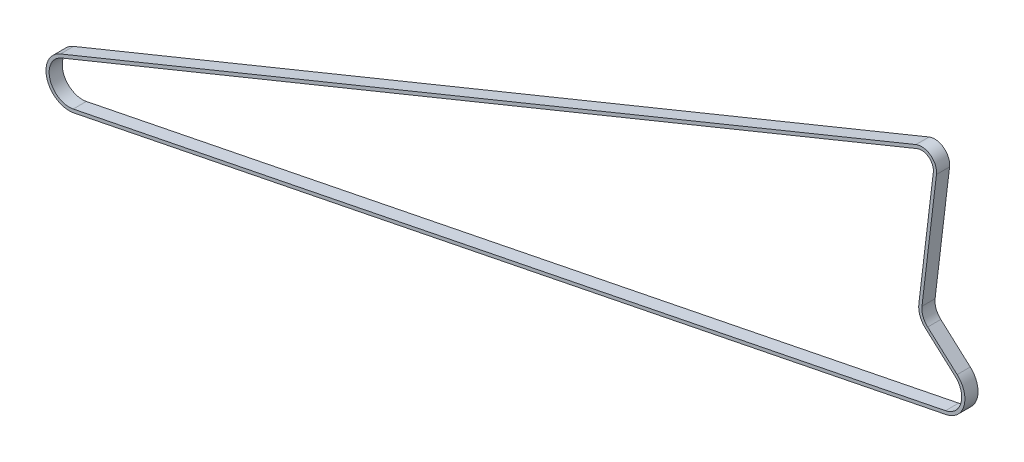
ISO-10303-21;
HEADER;
FILE_DESCRIPTION(('STEP AP214'),'2;1');
FILE_NAME('part.step','',(''),(''),'','','');
FILE_SCHEMA(('AUTOMOTIVE_DESIGN { 1 0 10303 214 1 1 1 1 }'));
ENDSEC;
DATA;
#1=APPLICATION_CONTEXT('core data for automotive mechanical design processes');
#2=APPLICATION_PROTOCOL_DEFINITION('international standard','automotive_design',2000,#1);
#3=PRODUCT_CONTEXT('',#1,'mechanical');
#4=PRODUCT('Part','Part','',(#3));
#5=PRODUCT_RELATED_PRODUCT_CATEGORY('part','',(#4));
#6=PRODUCT_DEFINITION_FORMATION('','',#4);
#7=PRODUCT_DEFINITION_CONTEXT('part definition',#1,'design');
#8=PRODUCT_DEFINITION('design','',#6,#7);
#9=PRODUCT_DEFINITION_SHAPE('','',#8);
#10=(LENGTH_UNIT() NAMED_UNIT(*) SI_UNIT(.MILLI.,.METRE.));
#11=(NAMED_UNIT(*) PLANE_ANGLE_UNIT() SI_UNIT($,.RADIAN.));
#12=(NAMED_UNIT(*) SI_UNIT($,.STERADIAN.) SOLID_ANGLE_UNIT());
#13=UNCERTAINTY_MEASURE_WITH_UNIT(LENGTH_MEASURE(1.E-05),#10,'distance_accuracy_value','');
#14=(GEOMETRIC_REPRESENTATION_CONTEXT(3) GLOBAL_UNCERTAINTY_ASSIGNED_CONTEXT((#13)) GLOBAL_UNIT_ASSIGNED_CONTEXT((#10,
#11,#12)) REPRESENTATION_CONTEXT('',''));
#15=CARTESIAN_POINT('',(0.,0.,0.));
#16=DIRECTION('',(0.,0.,1.));
#17=DIRECTION('',(1.,0.,0.));
#18=AXIS2_PLACEMENT_3D('',#15,#16,#17);
#19=CARTESIAN_POINT('',(0.,0.,0.));
#20=DIRECTION('',(0.,0.,-1.));
#21=DIRECTION('',(-1.,0.,0.));
#22=AXIS2_PLACEMENT_3D('',#19,#20,#21);
#23=CYLINDRICAL_SURFACE('',#22,9.2076525674065);
#24=DIRECTION('',(0.,0.,1.));
#25=VECTOR('',#24,1.);
#26=CARTESIAN_POINT('',(6.14978135792325,6.85281365949837,-3.));
#27=LINE('',#26,#25);
#28=CARTESIAN_POINT('',(6.14978135792325,6.85281365949837,-3.));
#29=VERTEX_POINT('',#28);
#30=CARTESIAN_POINT('',(6.14978135792325,6.85281365949837,3.));
#31=VERTEX_POINT('',#30);
#32=EDGE_CURVE('E262',#29,#31,#27,.T.);
#33=ORIENTED_EDGE('',*,*,#32,.F.);
#34=CARTESIAN_POINT('',(0.,0.,-3.));
#35=DIRECTION('',(0.,0.,-1.));
#36=DIRECTION('',(-1.,0.,0.));
#37=AXIS2_PLACEMENT_3D('',#34,#35,#36);
#38=CIRCLE('',#37,9.2076525674065);
#39=CARTESIAN_POINT('',(1.81012027581438,-9.0279748775211,-3.));
#40=VERTEX_POINT('',#39);
#41=EDGE_CURVE('E383',#29,#40,#38,.T.);
#42=ORIENTED_EDGE('',*,*,#41,.T.);
#43=CARTESIAN_POINT('',(1.81012027581438,-9.02797487752114,-3.));
#44=DIRECTION('',(0.,0.,1.));
#45=VECTOR('',#44,1.);
#46=LINE('',#43,#45);
#47=CARTESIAN_POINT('',(1.81012027581438,-9.0279748775211,3.));
#48=VERTEX_POINT('',#47);
#49=EDGE_CURVE('E360',#40,#48,#46,.T.);
#50=ORIENTED_EDGE('',*,*,#49,.T.);
#51=CARTESIAN_POINT('',(0.,0.,3.));
#52=DIRECTION('',(0.,0.,-1.));
#53=DIRECTION('',(-1.,0.,0.));
#54=AXIS2_PLACEMENT_3D('',#51,#52,#53);
#55=CIRCLE('',#54,9.2076525674065);
#56=EDGE_CURVE('E44',#31,#48,#55,.T.);
#57=ORIENTED_EDGE('',*,*,#56,.F.);
#58=EDGE_LOOP('',(#33,#42,#50,#57));
#59=FACE_BOUND('',#58,.T.);
#60=ADVANCED_FACE('F35',(#59),#23,.F.);
#61=CARTESIAN_POINT('',(0.,0.,0.));
#62=DIRECTION('',(0.,0.,-1.));
#63=DIRECTION('',(-1.,0.,0.));
#64=AXIS2_PLACEMENT_3D('',#61,#62,#63);
#65=CYLINDRICAL_SURFACE('',#64,10.6576525674065);
#66=DIRECTION('',(0.,0.,-1.));
#67=VECTOR('',#66,1.);
#68=CARTESIAN_POINT('',(7.11823481592558,7.93197903129426,-3.));
#69=LINE('',#68,#67);
#70=CARTESIAN_POINT('',(7.11823481592558,7.93197903129426,3.));
#71=VERTEX_POINT('',#70);
#72=CARTESIAN_POINT('',(7.11823481592558,7.93197903129426,-3.));
#73=VERTEX_POINT('',#72);
#74=EDGE_CURVE('E259',#71,#73,#69,.T.);
#75=ORIENTED_EDGE('',*,*,#74,.F.);
#76=CARTESIAN_POINT('',(0.,0.,3.));
#77=DIRECTION('',(0.,0.,-1.));
#78=DIRECTION('',(-1.,0.,0.));
#79=AXIS2_PLACEMENT_3D('',#76,#77,#78);
#80=CIRCLE('',#79,10.6576525674065);
#81=CARTESIAN_POINT('',(2.09517386365517,-10.4496796471759,3.));
#82=VERTEX_POINT('',#81);
#83=EDGE_CURVE('E11',#71,#82,#80,.T.);
#84=ORIENTED_EDGE('',*,*,#83,.T.);
#85=CARTESIAN_POINT('',(2.09517386365517,-10.4496796471759,3.));
#86=DIRECTION('',(0.,0.,-1.));
#87=VECTOR('',#86,1.);
#88=LINE('',#85,#87);
#89=CARTESIAN_POINT('',(2.09517386365517,-10.4496796471759,-3.));
#90=VERTEX_POINT('',#89);
#91=EDGE_CURVE('E52',#82,#90,#88,.T.);
#92=ORIENTED_EDGE('',*,*,#91,.T.);
#93=CARTESIAN_POINT('',(0.,0.,-3.));
#94=DIRECTION('',(0.,0.,-1.));
#95=DIRECTION('',(-1.,0.,0.));
#96=AXIS2_PLACEMENT_3D('',#93,#94,#95);
#97=CIRCLE('',#96,10.6576525674065);
#98=EDGE_CURVE('E168',#73,#90,#97,.T.);
#99=ORIENTED_EDGE('',*,*,#98,.F.);
#100=EDGE_LOOP('',(#75,#84,#92,#99));
#101=FACE_BOUND('',#100,.T.);
#102=ADVANCED_FACE('F279',(#101),#65,.T.);
#103=CARTESIAN_POINT('',(-7.32834242733819,18.9482125004542,-3.));
#104=DIRECTION('',(0.667898936553319,0.74425198054889,0.));
#105=DIRECTION('',(-0.74425198054889,0.667898936553319,0.));
#106=AXIS2_PLACEMENT_3D('',#103,#104,#105);
#107=PLANE('',#106);
#108=DIRECTION('',(0.,0.,1.));
#109=VECTOR('',#108,1.);
#110=CARTESIAN_POINT('',(-7.32834242733819,18.9482125004542,-3.));
#111=LINE('',#110,#109);
#112=CARTESIAN_POINT('',(-7.32834242733819,18.9482125004542,-3.));
#113=VERTEX_POINT('',#112);
#114=CARTESIAN_POINT('',(-7.32834242733819,18.9482125004542,3.));
#115=VERTEX_POINT('',#114);
#116=EDGE_CURVE('E244',#113,#115,#111,.T.);
#117=ORIENTED_EDGE('',*,*,#116,.F.);
#118=DIRECTION('',(0.74425198054889,-0.667898936553319,0.));
#119=VECTOR('',#118,1.);
#120=CARTESIAN_POINT('',(-7.32834242733819,18.9482125004542,-3.));
#121=LINE('',#120,#119);
#122=EDGE_CURVE('E267',#113,#29,#121,.T.);
#123=ORIENTED_EDGE('',*,*,#122,.T.);
#124=ORIENTED_EDGE('',*,*,#32,.T.);
#125=DIRECTION('',(0.74425198054889,-0.667898936553319,0.));
#126=VECTOR('',#125,1.);
#127=CARTESIAN_POINT('',(-7.32834242733819,18.9482125004542,3.));
#128=LINE('',#127,#126);
#129=EDGE_CURVE('E270',#115,#31,#128,.T.);
#130=ORIENTED_EDGE('',*,*,#129,.F.);
#131=EDGE_LOOP('',(#117,#123,#124,#130));
#132=FACE_BOUND('',#131,.T.);
#133=ADVANCED_FACE('F288',(#132),#107,.F.);
#134=CARTESIAN_POINT('',(-6.35988896933586,20.0273778722501,-3.));
#135=DIRECTION('',(-0.667898936553319,-0.74425198054889,0.));
#136=DIRECTION('',(0.74425198054889,-0.667898936553319,0.));
#137=AXIS2_PLACEMENT_3D('',#134,#135,#136);
#138=PLANE('',#137);
#139=DIRECTION('',(0.,0.,-1.));
#140=VECTOR('',#139,1.);
#141=CARTESIAN_POINT('',(-6.35988896933586,20.0273778722501,-3.));
#142=LINE('',#141,#140);
#143=CARTESIAN_POINT('',(-6.35988896933586,20.0273778722501,3.));
#144=VERTEX_POINT('',#143);
#145=CARTESIAN_POINT('',(-6.35988896933586,20.0273778722501,-3.));
#146=VERTEX_POINT('',#145);
#147=EDGE_CURVE('E241',#144,#146,#142,.T.);
#148=ORIENTED_EDGE('',*,*,#147,.F.);
#149=DIRECTION('',(0.74425198054889,-0.667898936553319,0.));
#150=VECTOR('',#149,1.);
#151=CARTESIAN_POINT('',(-6.35988896933586,20.0273778722501,3.));
#152=LINE('',#151,#150);
#153=EDGE_CURVE('E273',#144,#71,#152,.T.);
#154=ORIENTED_EDGE('',*,*,#153,.T.);
#155=ORIENTED_EDGE('',*,*,#74,.T.);
#156=DIRECTION('',(0.74425198054889,-0.667898936553319,0.));
#157=VECTOR('',#156,1.);
#158=CARTESIAN_POINT('',(-6.35988896933586,20.0273778722501,-3.));
#159=LINE('',#158,#157);
#160=EDGE_CURVE('E265',#146,#73,#159,.T.);
#161=ORIENTED_EDGE('',*,*,#160,.F.);
#162=EDGE_LOOP('',(#148,#154,#155,#161));
#163=FACE_BOUND('',#162,.T.);
#164=ADVANCED_FACE('F291',(#163),#138,.F.);
#165=CARTESIAN_POINT('',(-1.00000000349554,26.0000000161549,0.));
#166=DIRECTION('',(0.,0.,1.));
#167=DIRECTION('',(1.,0.,0.));
#168=AXIS2_PLACEMENT_3D('',#165,#166,#167);
#169=CYLINDRICAL_SURFACE('',#168,9.47499999999996);
#170=DIRECTION('',(0.,0.,1.));
#171=VECTOR('',#170,1.);
#172=CARTESIAN_POINT('',(-10.4082737750463,27.1225015259755,-3.));
#173=LINE('',#172,#171);
#174=CARTESIAN_POINT('',(-10.4082737750463,27.1225015259755,-3.));
#175=VERTEX_POINT('',#174);
#176=CARTESIAN_POINT('',(-10.4082737750463,27.1225015259755,3.));
#177=VERTEX_POINT('',#176);
#178=EDGE_CURVE('E226',#175,#177,#173,.T.);
#179=ORIENTED_EDGE('',*,*,#178,.F.);
#180=CARTESIAN_POINT('',(-1.00000000349554,26.0000000161549,-3.));
#181=DIRECTION('',(0.,0.,1.));
#182=DIRECTION('',(1.,0.,0.));
#183=AXIS2_PLACEMENT_3D('',#180,#181,#182);
#184=CIRCLE('',#183,9.47499999999996);
#185=EDGE_CURVE('E250',#175,#113,#184,.T.);
#186=ORIENTED_EDGE('',*,*,#185,.T.);
#187=ORIENTED_EDGE('',*,*,#116,.T.);
#188=CARTESIAN_POINT('',(-1.00000000349554,26.0000000161549,3.));
#189=DIRECTION('',(0.,0.,1.));
#190=DIRECTION('',(1.,0.,0.));
#191=AXIS2_PLACEMENT_3D('',#188,#189,#190);
#192=CIRCLE('',#191,9.47499999999996);
#193=EDGE_CURVE('E253',#177,#115,#192,.T.);
#194=ORIENTED_EDGE('',*,*,#193,.F.);
#195=EDGE_LOOP('',(#179,#186,#187,#194));
#196=FACE_BOUND('',#195,.T.);
#197=ADVANCED_FACE('F295',(#196),#169,.T.);
#198=CARTESIAN_POINT('',(-1.00000000349554,26.0000000161549,0.));
#199=DIRECTION('',(0.,0.,1.));
#200=DIRECTION('',(1.,0.,0.));
#201=AXIS2_PLACEMENT_3D('',#198,#199,#200);
#202=CYLINDRICAL_SURFACE('',#201,8.02499999999995);
#203=DIRECTION('',(0.,0.,-1.));
#204=VECTOR('',#203,1.);
#205=CARTESIAN_POINT('',(-8.96848517676146,26.9507202922826,-3.));
#206=LINE('',#205,#204);
#207=CARTESIAN_POINT('',(-8.96848517676146,26.9507202922826,3.));
#208=VERTEX_POINT('',#207);
#209=CARTESIAN_POINT('',(-8.96848517676146,26.9507202922826,-3.));
#210=VERTEX_POINT('',#209);
#211=EDGE_CURVE('E223',#208,#210,#206,.T.);
#212=ORIENTED_EDGE('',*,*,#211,.F.);
#213=CARTESIAN_POINT('',(-1.00000000349554,26.0000000161549,3.));
#214=DIRECTION('',(0.,0.,1.));
#215=DIRECTION('',(1.,0.,0.));
#216=AXIS2_PLACEMENT_3D('',#213,#214,#215);
#217=CIRCLE('',#216,8.02499999999995);
#218=EDGE_CURVE('E256',#208,#144,#217,.T.);
#219=ORIENTED_EDGE('',*,*,#218,.T.);
#220=ORIENTED_EDGE('',*,*,#147,.T.);
#221=CARTESIAN_POINT('',(-1.00000000349554,26.0000000161549,-3.));
#222=DIRECTION('',(0.,0.,1.));
#223=DIRECTION('',(1.,0.,0.));
#224=AXIS2_PLACEMENT_3D('',#221,#222,#223);
#225=CIRCLE('',#224,8.02499999999995);
#226=EDGE_CURVE('E247',#210,#146,#225,.T.);
#227=ORIENTED_EDGE('',*,*,#226,.F.);
#228=EDGE_LOOP('',(#212,#219,#220,#227));
#229=FACE_BOUND('',#228,.T.);
#230=ADVANCED_FACE('F299',(#229),#202,.F.);
#231=CARTESIAN_POINT('',(-3.78557558519489,82.6308078679699,-3.));
#232=DIRECTION('',(0.992957653989528,-0.11846981633991,0.));
#233=DIRECTION('',(0.11846981633991,0.992957653989528,0.));
#234=AXIS2_PLACEMENT_3D('',#231,#232,#233);
#235=PLANE('',#234);
#236=DIRECTION('',(0.,0.,1.));
#237=VECTOR('',#236,1.);
#238=CARTESIAN_POINT('',(-3.78557558519489,82.6308078679699,-3.));
#239=LINE('',#238,#237);
#240=CARTESIAN_POINT('',(-3.78557558519489,82.6308078679699,-3.));
#241=VERTEX_POINT('',#240);
#242=CARTESIAN_POINT('',(-3.78557558519489,82.6308078679699,3.));
#243=VERTEX_POINT('',#242);
#244=EDGE_CURVE('E208',#241,#243,#239,.T.);
#245=ORIENTED_EDGE('',*,*,#244,.F.);
#246=DIRECTION('',(-0.11846981633991,-0.992957653989528,0.));
#247=VECTOR('',#246,1.);
#248=CARTESIAN_POINT('',(-3.78557558519489,82.6308078679699,-3.));
#249=LINE('',#248,#247);
#250=EDGE_CURVE('E232',#241,#175,#249,.T.);
#251=ORIENTED_EDGE('',*,*,#250,.T.);
#252=ORIENTED_EDGE('',*,*,#178,.T.);
#253=DIRECTION('',(-0.11846981633991,-0.992957653989528,0.));
#254=VECTOR('',#253,1.);
#255=CARTESIAN_POINT('',(-3.78557558519489,82.6308078679699,3.));
#256=LINE('',#255,#254);
#257=EDGE_CURVE('E235',#243,#177,#256,.T.);
#258=ORIENTED_EDGE('',*,*,#257,.F.);
#259=EDGE_LOOP('',(#245,#251,#252,#258));
#260=FACE_BOUND('',#259,.T.);
#261=ADVANCED_FACE('F303',(#260),#235,.F.);
#262=CARTESIAN_POINT('',(-2.34578698691007,82.459026634277,-3.));
#263=DIRECTION('',(-0.992957653989528,0.11846981633991,0.));
#264=DIRECTION('',(-0.11846981633991,-0.992957653989528,0.));
#265=AXIS2_PLACEMENT_3D('',#262,#263,#264);
#266=PLANE('',#265);
#267=DIRECTION('',(0.,0.,-1.));
#268=VECTOR('',#267,1.);
#269=CARTESIAN_POINT('',(-2.34578698691007,82.459026634277,-3.));
#270=LINE('',#269,#268);
#271=CARTESIAN_POINT('',(-2.34578698691007,82.459026634277,3.));
#272=VERTEX_POINT('',#271);
#273=CARTESIAN_POINT('',(-2.34578698691007,82.459026634277,-3.));
#274=VERTEX_POINT('',#273);
#275=EDGE_CURVE('E205',#272,#274,#270,.T.);
#276=ORIENTED_EDGE('',*,*,#275,.F.);
#277=DIRECTION('',(-0.11846981633991,-0.992957653989528,0.));
#278=VECTOR('',#277,1.);
#279=CARTESIAN_POINT('',(-2.34578698691007,82.459026634277,3.));
#280=LINE('',#279,#278);
#281=EDGE_CURVE('E238',#272,#208,#280,.T.);
#282=ORIENTED_EDGE('',*,*,#281,.T.);
#283=ORIENTED_EDGE('',*,*,#211,.T.);
#284=DIRECTION('',(-0.11846981633991,-0.992957653989528,0.));
#285=VECTOR('',#284,1.);
#286=CARTESIAN_POINT('',(-2.34578698691007,82.459026634277,-3.));
#287=LINE('',#286,#285);
#288=EDGE_CURVE('E229',#274,#210,#287,.T.);
#289=ORIENTED_EDGE('',*,*,#288,.F.);
#290=EDGE_LOOP('',(#276,#282,#283,#289));
#291=FACE_BOUND('',#290,.T.);
#292=ADVANCED_FACE('F307',(#291),#266,.F.);
#293=CARTESIAN_POINT('',(-9.15000000342125,83.270837554073,0.));
#294=DIRECTION('',(0.,0.,-1.));
#295=DIRECTION('',(-1.,0.,0.));
#296=AXIS2_PLACEMENT_3D('',#293,#294,#295);
#297=CYLINDRICAL_SURFACE('',#296,5.40247048469091);
#298=DIRECTION('',(0.,0.,1.));
#299=VECTOR('',#298,1.);
#300=CARTESIAN_POINT('',(-11.1919986141999,88.272530168732,-3.));
#301=LINE('',#300,#299);
#302=CARTESIAN_POINT('',(-11.1919986141999,88.272530168732,-3.));
#303=VERTEX_POINT('',#302);
#304=CARTESIAN_POINT('',(-11.1919986141999,88.272530168732,3.));
#305=VERTEX_POINT('',#304);
#306=EDGE_CURVE('E191',#303,#305,#301,.T.);
#307=ORIENTED_EDGE('',*,*,#306,.F.);
#308=CARTESIAN_POINT('',(-9.15000000342125,83.270837554073,-3.));
#309=DIRECTION('',(0.,0.,-1.));
#310=DIRECTION('',(-1.,0.,0.));
#311=AXIS2_PLACEMENT_3D('',#308,#309,#310);
#312=CIRCLE('',#311,5.40247048469091);
#313=EDGE_CURVE('E214',#303,#241,#312,.T.);
#314=ORIENTED_EDGE('',*,*,#313,.T.);
#315=ORIENTED_EDGE('',*,*,#244,.T.);
#316=CARTESIAN_POINT('',(-9.15000000342125,83.270837554073,3.));
#317=DIRECTION('',(0.,0.,-1.));
#318=DIRECTION('',(-1.,0.,0.));
#319=AXIS2_PLACEMENT_3D('',#316,#317,#318);
#320=CIRCLE('',#319,5.40247048469091);
#321=EDGE_CURVE('E217',#305,#243,#320,.T.);
#322=ORIENTED_EDGE('',*,*,#321,.F.);
#323=EDGE_LOOP('',(#307,#314,#315,#322));
#324=FACE_BOUND('',#323,.T.);
#325=ADVANCED_FACE('F311',(#324),#297,.F.);
#326=CARTESIAN_POINT('',(-9.15000000342125,83.270837554073,0.));
#327=DIRECTION('',(0.,0.,-1.));
#328=DIRECTION('',(-1.,0.,0.));
#329=AXIS2_PLACEMENT_3D('',#326,#327,#328);
#330=CYLINDRICAL_SURFACE('',#329,6.85247048469091);
#331=DIRECTION('',(0.,0.,-1.));
#332=VECTOR('',#331,1.);
#333=CARTESIAN_POINT('',(-11.7400623183922,89.6149631004448,-3.));
#334=LINE('',#333,#332);
#335=CARTESIAN_POINT('',(-11.7400623183922,89.6149631004448,3.));
#336=VERTEX_POINT('',#335);
#337=CARTESIAN_POINT('',(-11.7400623183922,89.6149631004448,-3.));
#338=VERTEX_POINT('',#337);
#339=EDGE_CURVE('E188',#336,#338,#334,.T.);
#340=ORIENTED_EDGE('',*,*,#339,.F.);
#341=CARTESIAN_POINT('',(-9.15000000342125,83.270837554073,3.));
#342=DIRECTION('',(0.,0.,-1.));
#343=DIRECTION('',(-1.,0.,0.));
#344=AXIS2_PLACEMENT_3D('',#341,#342,#343);
#345=CIRCLE('',#344,6.85247048469091);
#346=EDGE_CURVE('E220',#336,#272,#345,.T.);
#347=ORIENTED_EDGE('',*,*,#346,.T.);
#348=ORIENTED_EDGE('',*,*,#275,.T.);
#349=CARTESIAN_POINT('',(-9.15000000342125,83.270837554073,-3.));
#350=DIRECTION('',(0.,0.,-1.));
#351=DIRECTION('',(-1.,0.,0.));
#352=AXIS2_PLACEMENT_3D('',#349,#350,#351);
#353=CIRCLE('',#352,6.85247048469091);
#354=EDGE_CURVE('E211',#338,#274,#353,.T.);
#355=ORIENTED_EDGE('',*,*,#354,.F.);
#356=EDGE_LOOP('',(#340,#347,#348,#355));
#357=FACE_BOUND('',#356,.T.);
#358=ADVANCED_FACE('F315',(#357),#330,.T.);
#359=CARTESIAN_POINT('',(-402.480262191639,-71.4754096181702,-3.));
#360=DIRECTION('',(-0.377974968408462,0.925815814974351,0.));
#361=DIRECTION('',(-0.925815814974351,-0.377974968408462,0.));
#362=AXIS2_PLACEMENT_3D('',#359,#360,#361);
#363=PLANE('',#362);
#364=DIRECTION('',(0.,0.,1.));
#365=VECTOR('',#364,1.);
#366=CARTESIAN_POINT('',(-402.480262191639,-71.4754096181702,-3.));
#367=LINE('',#366,#365);
#368=CARTESIAN_POINT('',(-402.480262191639,-71.4754096181702,-3.));
#369=VERTEX_POINT('',#368);
#370=CARTESIAN_POINT('',(-402.480262191639,-71.4754096181702,3.));
#371=VERTEX_POINT('',#370);
#372=EDGE_CURVE('E163',#369,#371,#367,.T.);
#373=ORIENTED_EDGE('',*,*,#372,.F.);
#374=DIRECTION('',(0.925815814974351,0.377974968408462,0.));
#375=VECTOR('',#374,1.);
#376=CARTESIAN_POINT('',(-402.480262191639,-71.4754096181702,-3.));
#377=LINE('',#376,#375);
#378=EDGE_CURVE('E196',#369,#303,#377,.T.);
#379=ORIENTED_EDGE('',*,*,#378,.T.);
#380=ORIENTED_EDGE('',*,*,#306,.T.);
#381=DIRECTION('',(0.925815814974351,0.377974968408462,0.));
#382=VECTOR('',#381,1.);
#383=CARTESIAN_POINT('',(-402.480262191639,-71.4754096181702,3.));
#384=LINE('',#383,#382);
#385=EDGE_CURVE('E199',#371,#305,#384,.T.);
#386=ORIENTED_EDGE('',*,*,#385,.F.);
#387=EDGE_LOOP('',(#373,#379,#380,#386));
#388=FACE_BOUND('',#387,.T.);
#389=ADVANCED_FACE('F319',(#388),#363,.F.);
#390=CARTESIAN_POINT('',(-403.028325895831,-70.1329766864574,-3.));
#391=DIRECTION('',(0.377974968408462,-0.925815814974351,0.));
#392=DIRECTION('',(0.925815814974351,0.377974968408462,0.));
#393=AXIS2_PLACEMENT_3D('',#390,#391,#392);
#394=PLANE('',#393);
#395=DIRECTION('',(0.,0.,-1.));
#396=VECTOR('',#395,1.);
#397=CARTESIAN_POINT('',(-403.028325895831,-70.1329766864574,-3.));
#398=LINE('',#397,#396);
#399=CARTESIAN_POINT('',(-403.028325895831,-70.1329766864574,3.));
#400=VERTEX_POINT('',#399);
#401=CARTESIAN_POINT('',(-403.028325895831,-70.1329766864574,-3.));
#402=VERTEX_POINT('',#401);
#403=EDGE_CURVE('E159',#400,#402,#398,.T.);
#404=ORIENTED_EDGE('',*,*,#403,.F.);
#405=DIRECTION('',(0.925815814974351,0.377974968408462,0.));
#406=VECTOR('',#405,1.);
#407=CARTESIAN_POINT('',(-403.028325895831,-70.1329766864574,3.));
#408=LINE('',#407,#406);
#409=EDGE_CURVE('E202',#400,#336,#408,.T.);
#410=ORIENTED_EDGE('',*,*,#409,.T.);
#411=ORIENTED_EDGE('',*,*,#339,.T.);
#412=DIRECTION('',(0.925815814974351,0.377974968408462,0.));
#413=VECTOR('',#412,1.);
#414=CARTESIAN_POINT('',(-403.028325895831,-70.1329766864574,-3.));
#415=LINE('',#414,#413);
#416=EDGE_CURVE('E194',#402,#338,#415,.T.);
#417=ORIENTED_EDGE('',*,*,#416,.F.);
#418=EDGE_LOOP('',(#404,#410,#411,#417));
#419=FACE_BOUND('',#418,.T.);
#420=ADVANCED_FACE('F323',(#419),#394,.F.);
#421=CARTESIAN_POINT('',(-399.000000003357,-79.9999999838643,0.));
#422=DIRECTION('',(0.,0.,-1.));
#423=DIRECTION('',(-1.,0.,0.));
#424=AXIS2_PLACEMENT_3D('',#421,#422,#423);
#425=CYLINDRICAL_SURFACE('',#424,9.20765256740647);
#426=DIRECTION('',(0.,0.,1.));
#427=VECTOR('',#426,1.);
#428=CARTESIAN_POINT('',(-397.189879727543,-89.0279748613854,-3.));
#429=LINE('',#428,#427);
#430=CARTESIAN_POINT('',(-397.189879727543,-89.0279748613854,-3.));
#431=VERTEX_POINT('',#430);
#432=CARTESIAN_POINT('',(-397.189879727543,-89.0279748613854,3.));
#433=VERTEX_POINT('',#432);
#434=EDGE_CURVE('E170',#431,#433,#429,.T.);
#435=ORIENTED_EDGE('',*,*,#434,.F.);
#436=CARTESIAN_POINT('',(-399.000000003357,-79.9999999838643,-3.));
#437=DIRECTION('',(0.,0.,-1.));
#438=DIRECTION('',(-1.,0.,0.));
#439=AXIS2_PLACEMENT_3D('',#436,#437,#438);
#440=CIRCLE('',#439,9.20765256740647);
#441=EDGE_CURVE('E162',#431,#369,#440,.T.);
#442=ORIENTED_EDGE('',*,*,#441,.T.);
#443=ORIENTED_EDGE('',*,*,#372,.T.);
#444=CARTESIAN_POINT('',(-399.000000003357,-79.9999999838643,3.));
#445=DIRECTION('',(0.,0.,-1.));
#446=DIRECTION('',(-1.,0.,0.));
#447=AXIS2_PLACEMENT_3D('',#444,#445,#446);
#448=CIRCLE('',#447,9.20765256740647);
#449=EDGE_CURVE('E183',#433,#371,#448,.T.);
#450=ORIENTED_EDGE('',*,*,#449,.F.);
#451=EDGE_LOOP('',(#435,#442,#443,#450));
#452=FACE_BOUND('',#451,.T.);
#453=ADVANCED_FACE('F327',(#452),#425,.F.);
#454=CARTESIAN_POINT('',(-399.000000003357,-79.9999999838643,0.));
#455=DIRECTION('',(0.,0.,-1.));
#456=DIRECTION('',(-1.,0.,0.));
#457=AXIS2_PLACEMENT_3D('',#454,#455,#456);
#458=CYLINDRICAL_SURFACE('',#457,10.6576525674065);
#459=DIRECTION('',(0.,0.,-1.));
#460=VECTOR('',#459,1.);
#461=CARTESIAN_POINT('',(-396.904826139702,-90.4496796310402,-3.));
#462=LINE('',#461,#460);
#463=CARTESIAN_POINT('',(-396.904826139702,-90.4496796310402,3.));
#464=VERTEX_POINT('',#463);
#465=CARTESIAN_POINT('',(-396.904826139702,-90.4496796310402,-3.));
#466=VERTEX_POINT('',#465);
#467=EDGE_CURVE('E157',#464,#466,#462,.T.);
#468=ORIENTED_EDGE('',*,*,#467,.F.);
#469=CARTESIAN_POINT('',(-399.000000003357,-79.9999999838643,3.));
#470=DIRECTION('',(0.,0.,-1.));
#471=DIRECTION('',(-1.,0.,0.));
#472=AXIS2_PLACEMENT_3D('',#469,#470,#471);
#473=CIRCLE('',#472,10.6576525674065);
#474=EDGE_CURVE('E186',#464,#400,#473,.T.);
#475=ORIENTED_EDGE('',*,*,#474,.T.);
#476=ORIENTED_EDGE('',*,*,#403,.T.);
#477=CARTESIAN_POINT('',(-399.000000003357,-79.9999999838643,-3.));
#478=DIRECTION('',(0.,0.,-1.));
#479=DIRECTION('',(-1.,0.,0.));
#480=AXIS2_PLACEMENT_3D('',#477,#478,#479);
#481=CIRCLE('',#480,10.6576525674065);
#482=EDGE_CURVE('E152',#466,#402,#481,.T.);
#483=ORIENTED_EDGE('',*,*,#482,.F.);
#484=EDGE_LOOP('',(#468,#475,#476,#483));
#485=FACE_BOUND('',#484,.T.);
#486=ADVANCED_FACE('F154',(#485),#458,.T.);
#487=CARTESIAN_POINT('',(-396.904826139702,-90.4496796310402,-3.));
#488=DIRECTION('',(0.196588681269524,-0.980486048037763,0.));
#489=DIRECTION('',(0.980486048037763,0.196588681269524,0.));
#490=AXIS2_PLACEMENT_3D('',#487,#488,#489);
#491=PLANE('',#490);
#492=ORIENTED_EDGE('',*,*,#91,.F.);
#493=DIRECTION('',(0.980486048037763,0.196588681269524,0.));
#494=VECTOR('',#493,1.);
#495=CARTESIAN_POINT('',(-396.904826139702,-90.4496796310402,3.));
#496=LINE('',#495,#494);
#497=EDGE_CURVE('E173',#464,#82,#496,.T.);
#498=ORIENTED_EDGE('',*,*,#497,.F.);
#499=ORIENTED_EDGE('',*,*,#467,.T.);
#500=DIRECTION('',(0.980486048037763,0.196588681269524,0.));
#501=VECTOR('',#500,1.);
#502=CARTESIAN_POINT('',(-396.904826139702,-90.4496796310402,-3.));
#503=LINE('',#502,#501);
#504=EDGE_CURVE('E165',#466,#90,#503,.T.);
#505=ORIENTED_EDGE('',*,*,#504,.T.);
#506=EDGE_LOOP('',(#492,#498,#499,#505));
#507=FACE_BOUND('',#506,.T.);
#508=ADVANCED_FACE('F172',(#507),#491,.T.);
#509=CARTESIAN_POINT('',(-396.904826139702,-90.4496796310402,3.));
#510=DIRECTION('',(0.,0.,1.));
#511=DIRECTION('',(1.,0.,0.));
#512=AXIS2_PLACEMENT_3D('',#509,#510,#511);
#513=PLANE('',#512);
#514=ORIENTED_EDGE('',*,*,#474,.F.);
#515=ORIENTED_EDGE('',*,*,#497,.T.);
#516=ORIENTED_EDGE('',*,*,#83,.F.);
#517=ORIENTED_EDGE('',*,*,#153,.F.);
#518=ORIENTED_EDGE('',*,*,#218,.F.);
#519=ORIENTED_EDGE('',*,*,#281,.F.);
#520=ORIENTED_EDGE('',*,*,#346,.F.);
#521=ORIENTED_EDGE('',*,*,#409,.F.);
#522=EDGE_LOOP('',(#514,#515,#516,#517,#518,#519,#520,#521));
#523=FACE_BOUND('',#522,.T.);
#524=DIRECTION('',(0.980486048037763,0.196588681269524,0.));
#525=VECTOR('',#524,1.);
#526=CARTESIAN_POINT('',(-397.189879727543,-89.0279748613854,3.));
#527=LINE('',#526,#525);
#528=EDGE_CURVE('E351',#433,#48,#527,.T.);
#529=ORIENTED_EDGE('',*,*,#528,.F.);
#530=ORIENTED_EDGE('',*,*,#449,.T.);
#531=ORIENTED_EDGE('',*,*,#385,.T.);
#532=ORIENTED_EDGE('',*,*,#321,.T.);
#533=ORIENTED_EDGE('',*,*,#257,.T.);
#534=ORIENTED_EDGE('',*,*,#193,.T.);
#535=ORIENTED_EDGE('',*,*,#129,.T.);
#536=ORIENTED_EDGE('',*,*,#56,.T.);
#537=EDGE_LOOP('',(#529,#530,#531,#532,#533,#534,#535,#536));
#538=FACE_BOUND('',#537,.T.);
#539=ADVANCED_FACE('F337',(#523,#538),#513,.T.);
#540=CARTESIAN_POINT('',(-397.189879727543,-89.0279748613854,-3.));
#541=DIRECTION('',(-0.196588681269524,0.980486048037763,0.));
#542=DIRECTION('',(-0.980486048037763,-0.196588681269524,0.));
#543=AXIS2_PLACEMENT_3D('',#540,#541,#542);
#544=PLANE('',#543);
#545=ORIENTED_EDGE('',*,*,#49,.F.);
#546=DIRECTION('',(0.980486048037763,0.196588681269524,0.));
#547=VECTOR('',#546,1.);
#548=CARTESIAN_POINT('',(-397.189879727543,-89.0279748613854,-3.));
#549=LINE('',#548,#547);
#550=EDGE_CURVE('E169',#431,#40,#549,.T.);
#551=ORIENTED_EDGE('',*,*,#550,.F.);
#552=ORIENTED_EDGE('',*,*,#434,.T.);
#553=ORIENTED_EDGE('',*,*,#528,.T.);
#554=EDGE_LOOP('',(#545,#551,#552,#553));
#555=FACE_BOUND('',#554,.T.);
#556=ADVANCED_FACE('F364',(#555),#544,.T.);
#557=CARTESIAN_POINT('',(-396.904826139702,-90.4496796310402,-3.));
#558=DIRECTION('',(0.,0.,-1.));
#559=DIRECTION('',(0.,1.,0.));
#560=AXIS2_PLACEMENT_3D('',#557,#558,#559);
#561=PLANE('',#560);
#562=ORIENTED_EDGE('',*,*,#441,.F.);
#563=ORIENTED_EDGE('',*,*,#550,.T.);
#564=ORIENTED_EDGE('',*,*,#41,.F.);
#565=ORIENTED_EDGE('',*,*,#122,.F.);
#566=ORIENTED_EDGE('',*,*,#185,.F.);
#567=ORIENTED_EDGE('',*,*,#250,.F.);
#568=ORIENTED_EDGE('',*,*,#313,.F.);
#569=ORIENTED_EDGE('',*,*,#378,.F.);
#570=EDGE_LOOP('',(#562,#563,#564,#565,#566,#567,#568,#569));
#571=FACE_BOUND('',#570,.T.);
#572=ORIENTED_EDGE('',*,*,#504,.F.);
#573=ORIENTED_EDGE('',*,*,#482,.T.);
#574=ORIENTED_EDGE('',*,*,#416,.T.);
#575=ORIENTED_EDGE('',*,*,#354,.T.);
#576=ORIENTED_EDGE('',*,*,#288,.T.);
#577=ORIENTED_EDGE('',*,*,#226,.T.);
#578=ORIENTED_EDGE('',*,*,#160,.T.);
#579=ORIENTED_EDGE('',*,*,#98,.T.);
#580=EDGE_LOOP('',(#572,#573,#574,#575,#576,#577,#578,#579));
#581=FACE_BOUND('',#580,.T.);
#582=ADVANCED_FACE('F166',(#571,#581),#561,.T.);
#583=CLOSED_SHELL('',(#60,#102,#133,#164,#197,#230,#261,#292,#325,#358,#389,#420,#453,#486,#508,
#539,#556,#582));
#584=MANIFOLD_SOLID_BREP('B2',#583);
#585=ADVANCED_BREP_SHAPE_REPRESENTATION('',(#18,#584),#14);
#586=SHAPE_DEFINITION_REPRESENTATION(#9,#585);
ENDSEC;
END-ISO-10303-21;
